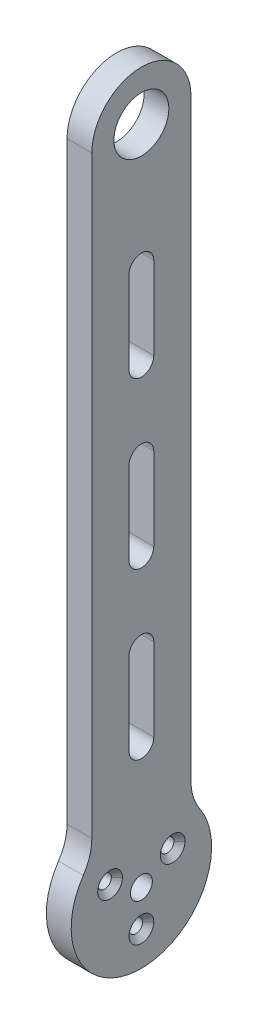
ISO-10303-21;
HEADER;
FILE_DESCRIPTION(('STEP AP214'),'2;1');
FILE_NAME('part.step','',(''),(''),'','','');
FILE_SCHEMA(('AUTOMOTIVE_DESIGN { 1 0 10303 214 1 1 1 1 }'));
ENDSEC;
DATA;
#1=APPLICATION_CONTEXT('core data for automotive mechanical design processes');
#2=APPLICATION_PROTOCOL_DEFINITION('international standard','automotive_design',2000,#1);
#3=PRODUCT_CONTEXT('',#1,'mechanical');
#4=PRODUCT('Part','Part','',(#3));
#5=PRODUCT_RELATED_PRODUCT_CATEGORY('part','',(#4));
#6=PRODUCT_DEFINITION_FORMATION('','',#4);
#7=PRODUCT_DEFINITION_CONTEXT('part definition',#1,'design');
#8=PRODUCT_DEFINITION('design','',#6,#7);
#9=PRODUCT_DEFINITION_SHAPE('','',#8);
#10=(LENGTH_UNIT() NAMED_UNIT(*) SI_UNIT(.MILLI.,.METRE.));
#11=(NAMED_UNIT(*) PLANE_ANGLE_UNIT() SI_UNIT($,.RADIAN.));
#12=(NAMED_UNIT(*) SI_UNIT($,.STERADIAN.) SOLID_ANGLE_UNIT());
#13=UNCERTAINTY_MEASURE_WITH_UNIT(LENGTH_MEASURE(1.E-05),#10,'distance_accuracy_value','');
#14=(GEOMETRIC_REPRESENTATION_CONTEXT(3) GLOBAL_UNCERTAINTY_ASSIGNED_CONTEXT((#13)) GLOBAL_UNIT_ASSIGNED_CONTEXT((#10,
#11,#12)) REPRESENTATION_CONTEXT('',''));
#15=CARTESIAN_POINT('',(0.,0.,0.));
#16=DIRECTION('',(0.,0.,1.));
#17=DIRECTION('',(1.,0.,0.));
#18=AXIS2_PLACEMENT_3D('',#15,#16,#17);
#19=CARTESIAN_POINT('',(1.4159414336793,4.375,7.57772228311384));
#20=DIRECTION('',(1.,0.,0.));
#21=DIRECTION('',(0.,0.,-1.));
#22=AXIS2_PLACEMENT_3D('',#19,#20,#21);
#23=CONICAL_SURFACE('',#22,1.4159414336793,0.785398163397449);
#24=DIRECTION('',(-0.707106781186547,-4.31774598039509E-08,-0.707106781186546));
#25=VECTOR('',#24,1.);
#26=CARTESIAN_POINT('',(2.99999998662978,4.37500018318645,10.5777222697436));
#27=LINE('',#26,#25);
#28=CARTESIAN_POINT('',(2.99999999539441,4.37500005514268,10.5777222785082));
#29=VERTEX_POINT('',#28);
#30=CARTESIAN_POINT('',(1.65,4.37500010075255,9.22772228311382));
#31=VERTEX_POINT('',#30);
#32=EDGE_CURVE('E55',#29,#31,#27,.T.);
#33=ORIENTED_EDGE('',*,*,#32,.T.);
#34=CARTESIAN_POINT('',(1.65,4.375,7.57772228311384));
#35=DIRECTION('',(1.,0.,0.));
#36=DIRECTION('',(0.,0.,-1.));
#37=AXIS2_PLACEMENT_3D('',#34,#35,#36);
#38=CIRCLE('',#37,1.65);
#39=CARTESIAN_POINT('',(1.65,4.37499989924745,5.92772228311384));
#40=VERTEX_POINT('',#39);
#41=EDGE_CURVE('E375',#31,#40,#38,.F.);
#42=ORIENTED_EDGE('',*,*,#41,.T.);
#43=DIRECTION('',(-0.707106781186547,4.31774602128291E-08,0.707106781186546));
#44=VECTOR('',#43,1.);
#45=CARTESIAN_POINT('',(2.99999998662978,4.37499981681355,4.57772229648406));
#46=LINE('',#45,#44);
#47=CARTESIAN_POINT('',(2.99999999539441,4.37499994485732,4.57772228771943));
#48=VERTEX_POINT('',#47);
#49=EDGE_CURVE('E12',#48,#40,#46,.T.);
#50=ORIENTED_EDGE('',*,*,#49,.F.);
#51=CARTESIAN_POINT('',(3.,4.375,7.57772228311384));
#52=DIRECTION('',(-1.,0.,0.));
#53=DIRECTION('',(0.,0.,1.));
#54=AXIS2_PLACEMENT_3D('',#51,#52,#53);
#55=CIRCLE('',#54,3.);
#56=EDGE_CURVE('E464',#29,#48,#55,.T.);
#57=ORIENTED_EDGE('',*,*,#56,.F.);
#58=EDGE_LOOP('',(#33,#42,#50,#57));
#59=FACE_BOUND('',#58,.T.);
#60=ADVANCED_FACE('F52',(#59),#23,.F.);
#61=CARTESIAN_POINT('',(1.4159414336793,4.375,7.57772228311384));
#62=DIRECTION('',(1.,0.,0.));
#63=DIRECTION('',(0.,0.,-1.));
#64=AXIS2_PLACEMENT_3D('',#61,#62,#63);
#65=CONICAL_SURFACE('',#64,1.4159414336793,0.785398163397449);
#66=ORIENTED_EDGE('',*,*,#49,.T.);
#67=CARTESIAN_POINT('',(1.65,4.375,7.57772228311384));
#68=DIRECTION('',(1.,0.,0.));
#69=DIRECTION('',(0.,0.,-1.));
#70=AXIS2_PLACEMENT_3D('',#67,#68,#69);
#71=CIRCLE('',#70,1.65);
#72=EDGE_CURVE('E371',#40,#31,#71,.F.);
#73=ORIENTED_EDGE('',*,*,#72,.T.);
#74=ORIENTED_EDGE('',*,*,#32,.F.);
#75=CARTESIAN_POINT('',(3.,4.375,7.57772228311384));
#76=DIRECTION('',(-1.,0.,0.));
#77=DIRECTION('',(0.,0.,-1.));
#78=AXIS2_PLACEMENT_3D('',#75,#76,#77);
#79=CIRCLE('',#78,3.);
#80=EDGE_CURVE('E460',#48,#29,#79,.T.);
#81=ORIENTED_EDGE('',*,*,#80,.F.);
#82=EDGE_LOOP('',(#66,#73,#74,#81));
#83=FACE_BOUND('',#82,.T.);
#84=ADVANCED_FACE('F539',(#83),#65,.F.);
#85=CARTESIAN_POINT('',(1.4159414336793,4.375,-7.57772228311384));
#86=DIRECTION('',(1.,0.,0.));
#87=DIRECTION('',(0.,0.,-1.));
#88=AXIS2_PLACEMENT_3D('',#85,#86,#87);
#89=CONICAL_SURFACE('',#88,1.4159414336793,0.785398163397449);
#90=DIRECTION('',(-0.707106781186547,-4.31774606217073E-08,-0.707106781186546));
#91=VECTOR('',#90,1.);
#92=CARTESIAN_POINT('',(2.99999998662979,4.37500018318645,-4.57772229648406));
#93=LINE('',#92,#91);
#94=CARTESIAN_POINT('',(2.99999999539441,4.37500005514268,-4.57772228771943));
#95=VERTEX_POINT('',#94);
#96=CARTESIAN_POINT('',(1.65,4.37500010075255,-5.92772228311385));
#97=VERTEX_POINT('',#96);
#98=EDGE_CURVE('E485',#95,#97,#93,.T.);
#99=ORIENTED_EDGE('',*,*,#98,.T.);
#100=CARTESIAN_POINT('',(1.65,4.375,-7.57772228311384));
#101=DIRECTION('',(1.,0.,0.));
#102=DIRECTION('',(0.,0.,-1.));
#103=AXIS2_PLACEMENT_3D('',#100,#101,#102);
#104=CIRCLE('',#103,1.65);
#105=CARTESIAN_POINT('',(1.65,4.37499989924745,-9.22772228311382));
#106=VERTEX_POINT('',#105);
#107=EDGE_CURVE('E383',#97,#106,#104,.F.);
#108=ORIENTED_EDGE('',*,*,#107,.T.);
#109=DIRECTION('',(-0.707106781186548,4.31774598039509E-08,0.707106781186546));
#110=VECTOR('',#109,1.);
#111=CARTESIAN_POINT('',(2.99999998662978,4.37499981681355,-10.5777222697436));
#112=LINE('',#111,#110);
#113=CARTESIAN_POINT('',(2.99999999539441,4.37499994485732,-10.5777222785082));
#114=VERTEX_POINT('',#113);
#115=EDGE_CURVE('E489',#114,#106,#112,.T.);
#116=ORIENTED_EDGE('',*,*,#115,.F.);
#117=CARTESIAN_POINT('',(3.,4.375,-7.57772228311384));
#118=DIRECTION('',(-1.,0.,0.));
#119=DIRECTION('',(0.,0.,1.));
#120=AXIS2_PLACEMENT_3D('',#117,#118,#119);
#121=CIRCLE('',#120,3.);
#122=EDGE_CURVE('E456',#95,#114,#121,.T.);
#123=ORIENTED_EDGE('',*,*,#122,.F.);
#124=EDGE_LOOP('',(#99,#108,#116,#123));
#125=FACE_BOUND('',#124,.T.);
#126=ADVANCED_FACE('F497',(#125),#89,.F.);
#127=CARTESIAN_POINT('',(1.4159414336793,4.375,-7.57772228311384));
#128=DIRECTION('',(1.,0.,0.));
#129=DIRECTION('',(0.,0.,-1.));
#130=AXIS2_PLACEMENT_3D('',#127,#128,#129);
#131=CONICAL_SURFACE('',#130,1.4159414336793,0.785398163397449);
#132=ORIENTED_EDGE('',*,*,#115,.T.);
#133=CARTESIAN_POINT('',(1.65,4.375,-7.57772228311384));
#134=DIRECTION('',(1.,0.,0.));
#135=DIRECTION('',(0.,0.,-1.));
#136=AXIS2_PLACEMENT_3D('',#133,#134,#135);
#137=CIRCLE('',#136,1.65);
#138=EDGE_CURVE('E379',#106,#97,#137,.F.);
#139=ORIENTED_EDGE('',*,*,#138,.T.);
#140=ORIENTED_EDGE('',*,*,#98,.F.);
#141=CARTESIAN_POINT('',(3.,4.375,-7.57772228311384));
#142=DIRECTION('',(-1.,0.,0.));
#143=DIRECTION('',(0.,0.,-1.));
#144=AXIS2_PLACEMENT_3D('',#141,#142,#143);
#145=CIRCLE('',#144,3.);
#146=EDGE_CURVE('E452',#114,#95,#145,.T.);
#147=ORIENTED_EDGE('',*,*,#146,.F.);
#148=EDGE_LOOP('',(#132,#139,#140,#147));
#149=FACE_BOUND('',#148,.T.);
#150=ADVANCED_FACE('F500',(#149),#131,.F.);
#151=CARTESIAN_POINT('',(1.4159414336793,-8.75,0.));
#152=DIRECTION('',(1.,0.,0.));
#153=DIRECTION('',(0.,0.,-1.));
#154=AXIS2_PLACEMENT_3D('',#151,#152,#153);
#155=CONICAL_SURFACE('',#154,1.4159414336793,0.785398163397449);
#156=DIRECTION('',(-0.707106781186547,-4.31774610305856E-08,-0.707106781186546));
#157=VECTOR('',#156,1.);
#158=CARTESIAN_POINT('',(2.99999998662978,-8.74999981681355,2.99999998662978));
#159=LINE('',#158,#157);
#160=CARTESIAN_POINT('',(2.99999999539441,-8.74999994485732,2.99999999539441));
#161=VERTEX_POINT('',#160);
#162=CARTESIAN_POINT('',(1.65,-8.74999989924745,1.65));
#163=VERTEX_POINT('',#162);
#164=EDGE_CURVE('E474',#161,#163,#159,.T.);
#165=ORIENTED_EDGE('',*,*,#164,.T.);
#166=CARTESIAN_POINT('',(1.65,-8.75,0.));
#167=DIRECTION('',(1.,0.,0.));
#168=DIRECTION('',(0.,0.,-1.));
#169=AXIS2_PLACEMENT_3D('',#166,#167,#168);
#170=CIRCLE('',#169,1.65);
#171=CARTESIAN_POINT('',(1.65,-8.75000010075255,-1.65));
#172=VERTEX_POINT('',#171);
#173=EDGE_CURVE('E367',#163,#172,#170,.F.);
#174=ORIENTED_EDGE('',*,*,#173,.T.);
#175=DIRECTION('',(-0.707106781186547,4.31774585773161E-08,0.707106781186546));
#176=VECTOR('',#175,1.);
#177=CARTESIAN_POINT('',(2.99999998662978,-8.75000018318645,-2.99999998662978));
#178=LINE('',#177,#176);
#179=CARTESIAN_POINT('',(2.99999999539441,-8.75000005514268,-2.99999999539441));
#180=VERTEX_POINT('',#179);
#181=EDGE_CURVE('E481',#180,#172,#178,.T.);
#182=ORIENTED_EDGE('',*,*,#181,.F.);
#183=CARTESIAN_POINT('',(3.,-8.75,0.));
#184=DIRECTION('',(-1.,0.,0.));
#185=DIRECTION('',(0.,0.,1.));
#186=AXIS2_PLACEMENT_3D('',#183,#184,#185);
#187=CIRCLE('',#186,3.);
#188=EDGE_CURVE('E448',#161,#180,#187,.T.);
#189=ORIENTED_EDGE('',*,*,#188,.F.);
#190=EDGE_LOOP('',(#165,#174,#182,#189));
#191=FACE_BOUND('',#190,.T.);
#192=ADVANCED_FACE('F772',(#191),#155,.F.);
#193=CARTESIAN_POINT('',(1.4159414336793,-8.75,0.));
#194=DIRECTION('',(1.,0.,0.));
#195=DIRECTION('',(0.,0.,-1.));
#196=AXIS2_PLACEMENT_3D('',#193,#194,#195);
#197=CONICAL_SURFACE('',#196,1.4159414336793,0.785398163397449);
#198=ORIENTED_EDGE('',*,*,#181,.T.);
#199=CARTESIAN_POINT('',(1.65,-8.75,0.));
#200=DIRECTION('',(1.,0.,0.));
#201=DIRECTION('',(0.,0.,-1.));
#202=AXIS2_PLACEMENT_3D('',#199,#200,#201);
#203=CIRCLE('',#202,1.65);
#204=EDGE_CURVE('E363',#172,#163,#203,.F.);
#205=ORIENTED_EDGE('',*,*,#204,.T.);
#206=ORIENTED_EDGE('',*,*,#164,.F.);
#207=CARTESIAN_POINT('',(3.,-8.75,0.));
#208=DIRECTION('',(-1.,0.,0.));
#209=DIRECTION('',(0.,0.,-1.));
#210=AXIS2_PLACEMENT_3D('',#207,#208,#209);
#211=CIRCLE('',#210,3.);
#212=EDGE_CURVE('E444',#180,#161,#211,.T.);
#213=ORIENTED_EDGE('',*,*,#212,.F.);
#214=EDGE_LOOP('',(#198,#205,#206,#213));
#215=FACE_BOUND('',#214,.T.);
#216=ADVANCED_FACE('F760',(#215),#197,.F.);
#217=CARTESIAN_POINT('',(-18.036,16.2788205960997,-24.));
#218=DIRECTION('',(1.,0.,0.));
#219=DIRECTION('',(0.,0.,1.));
#220=AXIS2_PLACEMENT_3D('',#217,#218,#219);
#221=CYLINDRICAL_SURFACE('',#220,12.);
#222=CARTESIAN_POINT('',(3.,16.2788205960997,-24.));
#223=DIRECTION('',(-1.,0.,0.));
#224=DIRECTION('',(0.,-0.561338641244817,0.827586206896552));
#225=AXIS2_PLACEMENT_3D('',#222,#223,#224);
#226=CIRCLE('',#225,12.);
#227=CARTESIAN_POINT('',(3.,9.5427569011619,-14.0689655172414));
#228=VERTEX_POINT('',#227);
#229=CARTESIAN_POINT('',(3.,16.2788205960997,-12.));
#230=VERTEX_POINT('',#229);
#231=EDGE_CURVE('E443',#228,#230,#226,.T.);
#232=ORIENTED_EDGE('',*,*,#231,.F.);
#233=DIRECTION('',(1.,0.,0.));
#234=VECTOR('',#233,1.);
#235=CARTESIAN_POINT('',(-3.,9.5427569011619,-14.0689655172414));
#236=LINE('',#235,#234);
#237=CARTESIAN_POINT('',(-3.,9.5427569011619,-14.0689655172414));
#238=VERTEX_POINT('',#237);
#239=EDGE_CURVE('E426',#238,#228,#236,.T.);
#240=ORIENTED_EDGE('',*,*,#239,.F.);
#241=CARTESIAN_POINT('',(-3.,16.2788205960997,-24.));
#242=DIRECTION('',(1.,0.,0.));
#243=DIRECTION('',(0.,0.,1.));
#244=AXIS2_PLACEMENT_3D('',#241,#242,#243);
#245=CIRCLE('',#244,12.);
#246=CARTESIAN_POINT('',(-3.,16.2788205960997,-12.));
#247=VERTEX_POINT('',#246);
#248=EDGE_CURVE('E400',#247,#238,#245,.T.);
#249=ORIENTED_EDGE('',*,*,#248,.F.);
#250=DIRECTION('',(1.,0.,0.));
#251=VECTOR('',#250,1.);
#252=CARTESIAN_POINT('',(-3.,16.2788205960997,-12.));
#253=LINE('',#252,#251);
#254=EDGE_CURVE('E471',#247,#230,#253,.T.);
#255=ORIENTED_EDGE('',*,*,#254,.T.);
#256=EDGE_LOOP('',(#232,#240,#249,#255));
#257=FACE_BOUND('',#256,.T.);
#258=ADVANCED_FACE('F748',(#257),#221,.F.);
#259=CARTESIAN_POINT('',(-3.,12.0415945787923,-12.));
#260=DIRECTION('',(0.,0.,-1.));
#261=DIRECTION('',(0.,1.,0.));
#262=AXIS2_PLACEMENT_3D('',#259,#260,#261);
#263=PLANE('',#262);
#264=DIRECTION('',(0.,1.,0.));
#265=VECTOR('',#264,1.);
#266=CARTESIAN_POINT('',(-3.,16.2788205960997,-12.));
#267=LINE('',#266,#265);
#268=CARTESIAN_POINT('',(-3.,160.,-12.));
#269=VERTEX_POINT('',#268);
#270=EDGE_CURVE('E401',#247,#269,#267,.T.);
#271=ORIENTED_EDGE('',*,*,#270,.T.);
#272=DIRECTION('',(1.,0.,0.));
#273=VECTOR('',#272,1.);
#274=CARTESIAN_POINT('',(-3.,160.,-12.));
#275=LINE('',#274,#273);
#276=CARTESIAN_POINT('',(3.,160.,-12.));
#277=VERTEX_POINT('',#276);
#278=EDGE_CURVE('E468',#269,#277,#275,.T.);
#279=ORIENTED_EDGE('',*,*,#278,.T.);
#280=DIRECTION('',(0.,1.,0.));
#281=VECTOR('',#280,1.);
#282=CARTESIAN_POINT('',(3.,16.2788205960997,-12.));
#283=LINE('',#282,#281);
#284=EDGE_CURVE('E439',#230,#277,#283,.T.);
#285=ORIENTED_EDGE('',*,*,#284,.F.);
#286=ORIENTED_EDGE('',*,*,#254,.F.);
#287=EDGE_LOOP('',(#271,#279,#285,#286));
#288=FACE_BOUND('',#287,.T.);
#289=ADVANCED_FACE('F735',(#288),#263,.T.);
#290=CARTESIAN_POINT('',(-3.,160.,0.));
#291=DIRECTION('',(1.,0.,0.));
#292=DIRECTION('',(0.,0.,-1.));
#293=AXIS2_PLACEMENT_3D('',#290,#291,#292);
#294=CYLINDRICAL_SURFACE('',#293,12.);
#295=DIRECTION('',(1.,0.,0.));
#296=VECTOR('',#295,1.);
#297=CARTESIAN_POINT('',(-3.,160.,12.));
#298=LINE('',#297,#296);
#299=CARTESIAN_POINT('',(-3.,160.,12.));
#300=VERTEX_POINT('',#299);
#301=CARTESIAN_POINT('',(3.,160.,12.));
#302=VERTEX_POINT('',#301);
#303=EDGE_CURVE('E411',#300,#302,#298,.T.);
#304=ORIENTED_EDGE('',*,*,#303,.T.);
#305=CARTESIAN_POINT('',(3.,160.,0.));
#306=DIRECTION('',(1.,0.,0.));
#307=DIRECTION('',(0.,0.,-1.));
#308=AXIS2_PLACEMENT_3D('',#305,#306,#307);
#309=CIRCLE('',#308,12.);
#310=EDGE_CURVE('E430',#277,#302,#309,.T.);
#311=ORIENTED_EDGE('',*,*,#310,.F.);
#312=ORIENTED_EDGE('',*,*,#278,.F.);
#313=CARTESIAN_POINT('',(-3.,160.,0.));
#314=DIRECTION('',(1.,0.,0.));
#315=DIRECTION('',(0.,0.,-1.));
#316=AXIS2_PLACEMENT_3D('',#313,#314,#315);
#317=CIRCLE('',#316,12.);
#318=EDGE_CURVE('E404',#269,#300,#317,.T.);
#319=ORIENTED_EDGE('',*,*,#318,.T.);
#320=EDGE_LOOP('',(#304,#311,#312,#319));
#321=FACE_BOUND('',#320,.T.);
#322=ADVANCED_FACE('F506',(#321),#294,.T.);
#323=CARTESIAN_POINT('',(3.,0.,0.));
#324=DIRECTION('',(1.,0.,0.));
#325=DIRECTION('',(0.,0.,-1.));
#326=AXIS2_PLACEMENT_3D('',#323,#324,#325);
#327=PLANE('',#326);
#328=CARTESIAN_POINT('',(3.,30.,0.));
#329=DIRECTION('',(1.,0.,0.));
#330=DIRECTION('',(0.,0.,-1.));
#331=AXIS2_PLACEMENT_3D('',#328,#329,#330);
#332=CIRCLE('',#331,3.);
#333=CARTESIAN_POINT('',(3.,30.,3.00000000000001));
#334=VERTEX_POINT('',#333);
#335=CARTESIAN_POINT('',(3.,30.,-2.99999999999999));
#336=VERTEX_POINT('',#335);
#337=EDGE_CURVE('E336',#334,#336,#332,.T.);
#338=ORIENTED_EDGE('',*,*,#337,.F.);
#339=DIRECTION('',(0.,-1.,0.));
#340=VECTOR('',#339,1.);
#341=CARTESIAN_POINT('',(3.,0.,3.00000000000001));
#342=LINE('',#341,#340);
#343=CARTESIAN_POINT('',(3.,50.,3.00000000000001));
#344=VERTEX_POINT('',#343);
#345=EDGE_CURVE('E326',#344,#334,#342,.T.);
#346=ORIENTED_EDGE('',*,*,#345,.F.);
#347=CARTESIAN_POINT('',(3.,50.,0.));
#348=DIRECTION('',(1.,0.,0.));
#349=DIRECTION('',(0.,0.,-1.));
#350=AXIS2_PLACEMENT_3D('',#347,#348,#349);
#351=CIRCLE('',#350,3.);
#352=CARTESIAN_POINT('',(3.,50.,-2.99999999999999));
#353=VERTEX_POINT('',#352);
#354=EDGE_CURVE('E329',#353,#344,#351,.T.);
#355=ORIENTED_EDGE('',*,*,#354,.F.);
#356=DIRECTION('',(0.,-1.,0.));
#357=VECTOR('',#356,1.);
#358=CARTESIAN_POINT('',(3.,0.,-2.99999999999999));
#359=LINE('',#358,#357);
#360=EDGE_CURVE('E332',#353,#336,#359,.T.);
#361=ORIENTED_EDGE('',*,*,#360,.T.);
#362=EDGE_LOOP('',(#338,#346,#355,#361));
#363=FACE_BOUND('',#362,.T.);
#364=CARTESIAN_POINT('',(3.,110.,0.));
#365=DIRECTION('',(1.,0.,0.));
#366=DIRECTION('',(0.,0.,-1.));
#367=AXIS2_PLACEMENT_3D('',#364,#365,#366);
#368=CIRCLE('',#367,3.);
#369=CARTESIAN_POINT('',(3.,110.,3.));
#370=VERTEX_POINT('',#369);
#371=CARTESIAN_POINT('',(3.,110.,-3.));
#372=VERTEX_POINT('',#371);
#373=EDGE_CURVE('E220',#370,#372,#368,.T.);
#374=ORIENTED_EDGE('',*,*,#373,.F.);
#375=DIRECTION('',(0.,-1.,0.));
#376=VECTOR('',#375,1.);
#377=CARTESIAN_POINT('',(3.,0.,3.));
#378=LINE('',#377,#376);
#379=CARTESIAN_POINT('',(3.,130.,3.));
#380=VERTEX_POINT('',#379);
#381=EDGE_CURVE('E315',#380,#370,#378,.T.);
#382=ORIENTED_EDGE('',*,*,#381,.F.);
#383=CARTESIAN_POINT('',(3.,130.,0.));
#384=DIRECTION('',(1.,0.,0.));
#385=DIRECTION('',(0.,0.,-1.));
#386=AXIS2_PLACEMENT_3D('',#383,#384,#385);
#387=CIRCLE('',#386,3.);
#388=CARTESIAN_POINT('',(3.,130.,-3.));
#389=VERTEX_POINT('',#388);
#390=EDGE_CURVE('E318',#389,#380,#387,.T.);
#391=ORIENTED_EDGE('',*,*,#390,.F.);
#392=DIRECTION('',(0.,-1.,0.));
#393=VECTOR('',#392,1.);
#394=CARTESIAN_POINT('',(3.,0.,-3.));
#395=LINE('',#394,#393);
#396=EDGE_CURVE('E321',#389,#372,#395,.T.);
#397=ORIENTED_EDGE('',*,*,#396,.T.);
#398=EDGE_LOOP('',(#374,#382,#391,#397));
#399=FACE_BOUND('',#398,.T.);
#400=CARTESIAN_POINT('',(3.,70.,0.));
#401=DIRECTION('',(1.,0.,0.));
#402=DIRECTION('',(0.,0.,-1.));
#403=AXIS2_PLACEMENT_3D('',#400,#401,#402);
#404=CIRCLE('',#403,3.);
#405=CARTESIAN_POINT('',(3.,70.,3.00000000000001));
#406=VERTEX_POINT('',#405);
#407=CARTESIAN_POINT('',(3.,70.,-2.99999999999999));
#408=VERTEX_POINT('',#407);
#409=EDGE_CURVE('E312',#406,#408,#404,.T.);
#410=ORIENTED_EDGE('',*,*,#409,.F.);
#411=DIRECTION('',(0.,-1.,0.));
#412=VECTOR('',#411,1.);
#413=CARTESIAN_POINT('',(3.,0.,3.00000000000001));
#414=LINE('',#413,#412);
#415=CARTESIAN_POINT('',(3.,90.,3.00000000000001));
#416=VERTEX_POINT('',#415);
#417=EDGE_CURVE('E292',#416,#406,#414,.T.);
#418=ORIENTED_EDGE('',*,*,#417,.F.);
#419=CARTESIAN_POINT('',(3.,90.,0.));
#420=DIRECTION('',(1.,0.,0.));
#421=DIRECTION('',(0.,0.,-1.));
#422=AXIS2_PLACEMENT_3D('',#419,#420,#421);
#423=CIRCLE('',#422,3.);
#424=CARTESIAN_POINT('',(3.,90.,-2.99999999999999));
#425=VERTEX_POINT('',#424);
#426=EDGE_CURVE('E304',#425,#416,#423,.T.);
#427=ORIENTED_EDGE('',*,*,#426,.F.);
#428=DIRECTION('',(0.,-1.,0.));
#429=VECTOR('',#428,1.);
#430=CARTESIAN_POINT('',(3.,0.,-2.99999999999999));
#431=LINE('',#430,#429);
#432=EDGE_CURVE('E308',#425,#408,#431,.T.);
#433=ORIENTED_EDGE('',*,*,#432,.T.);
#434=EDGE_LOOP('',(#410,#418,#427,#433));
#435=FACE_BOUND('',#434,.T.);
#436=ORIENTED_EDGE('',*,*,#231,.T.);
#437=ORIENTED_EDGE('',*,*,#284,.T.);
#438=ORIENTED_EDGE('',*,*,#310,.T.);
#439=DIRECTION('',(0.,-1.,0.));
#440=VECTOR('',#439,1.);
#441=CARTESIAN_POINT('',(3.,160.,12.));
#442=LINE('',#441,#440);
#443=CARTESIAN_POINT('',(3.,16.2788205960997,12.));
#444=VERTEX_POINT('',#443);
#445=EDGE_CURVE('E414',#302,#444,#442,.T.);
#446=ORIENTED_EDGE('',*,*,#445,.T.);
#447=CARTESIAN_POINT('',(3.,16.2788205960997,24.));
#448=DIRECTION('',(-1.,0.,0.));
#449=DIRECTION('',(0.,0.,-1.));
#450=AXIS2_PLACEMENT_3D('',#447,#448,#449);
#451=CIRCLE('',#450,12.);
#452=CARTESIAN_POINT('',(3.,9.5427569011619,14.0689655172414));
#453=VERTEX_POINT('',#452);
#454=EDGE_CURVE('E418',#444,#453,#451,.T.);
#455=ORIENTED_EDGE('',*,*,#454,.T.);
#456=CARTESIAN_POINT('',(3.,0.,0.));
#457=DIRECTION('',(1.,0.,0.));
#458=DIRECTION('',(0.,0.561338641244818,0.827586206896552));
#459=AXIS2_PLACEMENT_3D('',#456,#457,#458);
#460=CIRCLE('',#459,17.);
#461=EDGE_CURVE('E421',#453,#228,#460,.T.);
#462=ORIENTED_EDGE('',*,*,#461,.T.);
#463=EDGE_LOOP('',(#436,#437,#438,#446,#455,#462));
#464=FACE_BOUND('',#463,.T.);
#465=ORIENTED_EDGE('',*,*,#188,.T.);
#466=ORIENTED_EDGE('',*,*,#212,.T.);
#467=EDGE_LOOP('',(#465,#466));
#468=FACE_BOUND('',#467,.T.);
#469=ORIENTED_EDGE('',*,*,#122,.T.);
#470=ORIENTED_EDGE('',*,*,#146,.T.);
#471=EDGE_LOOP('',(#469,#470));
#472=FACE_BOUND('',#471,.T.);
#473=ORIENTED_EDGE('',*,*,#56,.T.);
#474=ORIENTED_EDGE('',*,*,#80,.T.);
#475=EDGE_LOOP('',(#473,#474));
#476=FACE_BOUND('',#475,.T.);
#477=CARTESIAN_POINT('',(3.,0.,0.));
#478=DIRECTION('',(1.,0.,0.));
#479=DIRECTION('',(0.,0.,-1.));
#480=AXIS2_PLACEMENT_3D('',#477,#478,#479);
#481=CIRCLE('',#480,2.65);
#482=CARTESIAN_POINT('',(3.,0.,-2.65));
#483=VERTEX_POINT('',#482);
#484=EDGE_CURVE('E344',#483,#483,#481,.T.);
#485=ORIENTED_EDGE('',*,*,#484,.F.);
#486=EDGE_LOOP('',(#485));
#487=FACE_BOUND('',#486,.T.);
#488=CARTESIAN_POINT('',(3.,160.,0.));
#489=DIRECTION('',(1.,0.,0.));
#490=DIRECTION('',(0.,0.,-1.));
#491=AXIS2_PLACEMENT_3D('',#488,#489,#490);
#492=CIRCLE('',#491,6.65);
#493=CARTESIAN_POINT('',(3.,160.,-6.65));
#494=VERTEX_POINT('',#493);
#495=EDGE_CURVE('E387',#494,#494,#492,.T.);
#496=ORIENTED_EDGE('',*,*,#495,.F.);
#497=EDGE_LOOP('',(#496));
#498=FACE_BOUND('',#497,.T.);
#499=ADVANCED_FACE('F502',(#363,#399,#435,#464,#468,#472,#476,#487,#498),#327,.T.);
#500=CARTESIAN_POINT('',(-3.,0.,0.));
#501=DIRECTION('',(1.,0.,0.));
#502=DIRECTION('',(0.,0.,-1.));
#503=AXIS2_PLACEMENT_3D('',#500,#501,#502);
#504=CYLINDRICAL_SURFACE('',#503,17.);
#505=ORIENTED_EDGE('',*,*,#239,.T.);
#506=ORIENTED_EDGE('',*,*,#461,.F.);
#507=DIRECTION('',(1.,0.,0.));
#508=VECTOR('',#507,1.);
#509=CARTESIAN_POINT('',(-3.,9.5427569011619,14.0689655172414));
#510=LINE('',#509,#508);
#511=CARTESIAN_POINT('',(-3.,9.5427569011619,14.0689655172414));
#512=VERTEX_POINT('',#511);
#513=EDGE_CURVE('E422',#512,#453,#510,.T.);
#514=ORIENTED_EDGE('',*,*,#513,.F.);
#515=CARTESIAN_POINT('',(-3.,0.,0.));
#516=DIRECTION('',(1.,0.,0.));
#517=DIRECTION('',(0.,0.561338641244818,0.827586206896552));
#518=AXIS2_PLACEMENT_3D('',#515,#516,#517);
#519=CIRCLE('',#518,17.);
#520=EDGE_CURVE('E396',#512,#238,#519,.T.);
#521=ORIENTED_EDGE('',*,*,#520,.T.);
#522=EDGE_LOOP('',(#505,#506,#514,#521));
#523=FACE_BOUND('',#522,.T.);
#524=ADVANCED_FACE('F505',(#523),#504,.T.);
#525=CARTESIAN_POINT('',(-18.036,16.2788205960997,24.));
#526=DIRECTION('',(1.,0.,0.));
#527=DIRECTION('',(0.,-0.561338641244817,-0.827586206896552));
#528=AXIS2_PLACEMENT_3D('',#525,#526,#527);
#529=CYLINDRICAL_SURFACE('',#528,12.);
#530=ORIENTED_EDGE('',*,*,#454,.F.);
#531=DIRECTION('',(1.,0.,0.));
#532=VECTOR('',#531,1.);
#533=CARTESIAN_POINT('',(-3.,16.2788205960997,12.));
#534=LINE('',#533,#532);
#535=CARTESIAN_POINT('',(-3.,16.2788205960997,12.));
#536=VERTEX_POINT('',#535);
#537=EDGE_CURVE('E407',#536,#444,#534,.T.);
#538=ORIENTED_EDGE('',*,*,#537,.F.);
#539=CARTESIAN_POINT('',(-3.,16.2788205960997,24.));
#540=DIRECTION('',(1.,0.,0.));
#541=DIRECTION('',(0.,-0.561338641244817,-0.827586206896552));
#542=AXIS2_PLACEMENT_3D('',#539,#540,#541);
#543=CIRCLE('',#542,12.);
#544=EDGE_CURVE('E395',#512,#536,#543,.T.);
#545=ORIENTED_EDGE('',*,*,#544,.F.);
#546=ORIENTED_EDGE('',*,*,#513,.T.);
#547=EDGE_LOOP('',(#530,#538,#545,#546));
#548=FACE_BOUND('',#547,.T.);
#549=ADVANCED_FACE('F534',(#548),#529,.F.);
#550=CARTESIAN_POINT('',(-3.,160.,12.));
#551=DIRECTION('',(0.,0.,1.));
#552=DIRECTION('',(0.,-1.,0.));
#553=AXIS2_PLACEMENT_3D('',#550,#551,#552);
#554=PLANE('',#553);
#555=ORIENTED_EDGE('',*,*,#445,.F.);
#556=ORIENTED_EDGE('',*,*,#303,.F.);
#557=DIRECTION('',(0.,-1.,0.));
#558=VECTOR('',#557,1.);
#559=CARTESIAN_POINT('',(-3.,160.,12.));
#560=LINE('',#559,#558);
#561=EDGE_CURVE('E391',#300,#536,#560,.T.);
#562=ORIENTED_EDGE('',*,*,#561,.T.);
#563=ORIENTED_EDGE('',*,*,#537,.T.);
#564=EDGE_LOOP('',(#555,#556,#562,#563));
#565=FACE_BOUND('',#564,.T.);
#566=ADVANCED_FACE('F524',(#565),#554,.T.);
#567=CARTESIAN_POINT('',(-3.,0.,0.));
#568=DIRECTION('',(1.,0.,0.));
#569=DIRECTION('',(0.,0.,-1.));
#570=AXIS2_PLACEMENT_3D('',#567,#568,#569);
#571=PLANE('',#570);
#572=DIRECTION('',(0.,1.,0.));
#573=VECTOR('',#572,1.);
#574=CARTESIAN_POINT('',(-3.,30.,3.00000000000001));
#575=LINE('',#574,#573);
#576=CARTESIAN_POINT('',(-3.,30.,3.00000000000001));
#577=VERTEX_POINT('',#576);
#578=CARTESIAN_POINT('',(-3.,50.,3.00000000000001));
#579=VERTEX_POINT('',#578);
#580=EDGE_CURVE('E272',#577,#579,#575,.T.);
#581=ORIENTED_EDGE('',*,*,#580,.F.);
#582=CARTESIAN_POINT('',(-3.,30.,0.));
#583=DIRECTION('',(-1.,0.,0.));
#584=DIRECTION('',(0.,0.,1.));
#585=AXIS2_PLACEMENT_3D('',#582,#583,#584);
#586=CIRCLE('',#585,3.);
#587=CARTESIAN_POINT('',(-3.,30.,-2.99999999999999));
#588=VERTEX_POINT('',#587);
#589=EDGE_CURVE('E225',#588,#577,#586,.T.);
#590=ORIENTED_EDGE('',*,*,#589,.F.);
#591=DIRECTION('',(0.,1.,0.));
#592=VECTOR('',#591,1.);
#593=CARTESIAN_POINT('',(-3.,30.,-2.99999999999999));
#594=LINE('',#593,#592);
#595=CARTESIAN_POINT('',(-3.,50.,-2.99999999999999));
#596=VERTEX_POINT('',#595);
#597=EDGE_CURVE('E256',#588,#596,#594,.T.);
#598=ORIENTED_EDGE('',*,*,#597,.T.);
#599=CARTESIAN_POINT('',(-3.,50.,0.));
#600=DIRECTION('',(-1.,0.,0.));
#601=DIRECTION('',(0.,0.,1.));
#602=AXIS2_PLACEMENT_3D('',#599,#600,#601);
#603=CIRCLE('',#602,3.);
#604=EDGE_CURVE('E268',#579,#596,#603,.T.);
#605=ORIENTED_EDGE('',*,*,#604,.F.);
#606=EDGE_LOOP('',(#581,#590,#598,#605));
#607=FACE_BOUND('',#606,.T.);
#608=DIRECTION('',(0.,1.,0.));
#609=VECTOR('',#608,1.);
#610=CARTESIAN_POINT('',(-3.,110.,3.));
#611=LINE('',#610,#609);
#612=CARTESIAN_POINT('',(-3.,110.,3.));
#613=VERTEX_POINT('',#612);
#614=CARTESIAN_POINT('',(-3.,130.,3.));
#615=VERTEX_POINT('',#614);
#616=EDGE_CURVE('E241',#613,#615,#611,.T.);
#617=ORIENTED_EDGE('',*,*,#616,.F.);
#618=CARTESIAN_POINT('',(-3.,110.,0.));
#619=DIRECTION('',(-1.,0.,0.));
#620=DIRECTION('',(0.,0.,1.));
#621=AXIS2_PLACEMENT_3D('',#618,#619,#620);
#622=CIRCLE('',#621,3.);
#623=CARTESIAN_POINT('',(-3.,110.,-3.));
#624=VERTEX_POINT('',#623);
#625=EDGE_CURVE('E217',#624,#613,#622,.T.);
#626=ORIENTED_EDGE('',*,*,#625,.F.);
#627=DIRECTION('',(0.,1.,0.));
#628=VECTOR('',#627,1.);
#629=CARTESIAN_POINT('',(-3.,110.,-3.));
#630=LINE('',#629,#628);
#631=CARTESIAN_POINT('',(-3.,130.,-3.));
#632=VERTEX_POINT('',#631);
#633=EDGE_CURVE('E228',#624,#632,#630,.T.);
#634=ORIENTED_EDGE('',*,*,#633,.T.);
#635=CARTESIAN_POINT('',(-3.,130.,0.));
#636=DIRECTION('',(-1.,0.,0.));
#637=DIRECTION('',(0.,0.,1.));
#638=AXIS2_PLACEMENT_3D('',#635,#636,#637);
#639=CIRCLE('',#638,3.);
#640=EDGE_CURVE('E235',#615,#632,#639,.T.);
#641=ORIENTED_EDGE('',*,*,#640,.F.);
#642=EDGE_LOOP('',(#617,#626,#634,#641));
#643=FACE_BOUND('',#642,.T.);
#644=DIRECTION('',(0.,1.,0.));
#645=VECTOR('',#644,1.);
#646=CARTESIAN_POINT('',(-3.,70.,3.00000000000001));
#647=LINE('',#646,#645);
#648=CARTESIAN_POINT('',(-3.,70.,3.00000000000001));
#649=VERTEX_POINT('',#648);
#650=CARTESIAN_POINT('',(-3.,90.,3.00000000000001));
#651=VERTEX_POINT('',#650);
#652=EDGE_CURVE('E247',#649,#651,#647,.T.);
#653=ORIENTED_EDGE('',*,*,#652,.F.);
#654=CARTESIAN_POINT('',(-3.,70.,0.));
#655=DIRECTION('',(-1.,0.,0.));
#656=DIRECTION('',(0.,0.,1.));
#657=AXIS2_PLACEMENT_3D('',#654,#655,#656);
#658=CIRCLE('',#657,3.);
#659=CARTESIAN_POINT('',(-3.,70.,-2.99999999999999));
#660=VERTEX_POINT('',#659);
#661=EDGE_CURVE('E243',#660,#649,#658,.T.);
#662=ORIENTED_EDGE('',*,*,#661,.F.);
#663=DIRECTION('',(0.,1.,0.));
#664=VECTOR('',#663,1.);
#665=CARTESIAN_POINT('',(-3.,70.,-2.99999999999999));
#666=LINE('',#665,#664);
#667=CARTESIAN_POINT('',(-3.,90.,-2.99999999999999));
#668=VERTEX_POINT('',#667);
#669=EDGE_CURVE('E284',#660,#668,#666,.T.);
#670=ORIENTED_EDGE('',*,*,#669,.T.);
#671=CARTESIAN_POINT('',(-3.,90.,0.));
#672=DIRECTION('',(-1.,0.,0.));
#673=DIRECTION('',(0.,0.,1.));
#674=AXIS2_PLACEMENT_3D('',#671,#672,#673);
#675=CIRCLE('',#674,3.);
#676=EDGE_CURVE('E280',#651,#668,#675,.T.);
#677=ORIENTED_EDGE('',*,*,#676,.F.);
#678=EDGE_LOOP('',(#653,#662,#670,#677));
#679=FACE_BOUND('',#678,.T.);
#680=ORIENTED_EDGE('',*,*,#318,.F.);
#681=ORIENTED_EDGE('',*,*,#270,.F.);
#682=ORIENTED_EDGE('',*,*,#248,.T.);
#683=ORIENTED_EDGE('',*,*,#520,.F.);
#684=ORIENTED_EDGE('',*,*,#544,.T.);
#685=ORIENTED_EDGE('',*,*,#561,.F.);
#686=EDGE_LOOP('',(#680,#681,#682,#683,#684,#685));
#687=FACE_BOUND('',#686,.T.);
#688=CARTESIAN_POINT('',(-3.,0.,0.));
#689=DIRECTION('',(-1.,0.,0.));
#690=DIRECTION('',(0.,0.,1.));
#691=AXIS2_PLACEMENT_3D('',#688,#689,#690);
#692=CIRCLE('',#691,2.65);
#693=CARTESIAN_POINT('',(-3.,0.,2.65));
#694=VERTEX_POINT('',#693);
#695=EDGE_CURVE('E339',#694,#694,#692,.T.);
#696=ORIENTED_EDGE('',*,*,#695,.F.);
#697=EDGE_LOOP('',(#696));
#698=FACE_BOUND('',#697,.T.);
#699=CARTESIAN_POINT('',(-3.,-8.75,0.));
#700=DIRECTION('',(-1.,0.,0.));
#701=DIRECTION('',(0.,0.,1.));
#702=AXIS2_PLACEMENT_3D('',#699,#700,#701);
#703=CIRCLE('',#702,1.65);
#704=CARTESIAN_POINT('',(-3.,-8.75,1.65));
#705=VERTEX_POINT('',#704);
#706=EDGE_CURVE('E353',#705,#705,#703,.T.);
#707=ORIENTED_EDGE('',*,*,#706,.F.);
#708=EDGE_LOOP('',(#707));
#709=FACE_BOUND('',#708,.T.);
#710=CARTESIAN_POINT('',(-3.,4.375,7.57772228311384));
#711=DIRECTION('',(-1.,0.,0.));
#712=DIRECTION('',(0.,0.,1.));
#713=AXIS2_PLACEMENT_3D('',#710,#711,#712);
#714=CIRCLE('',#713,1.65);
#715=CARTESIAN_POINT('',(-3.,4.375,9.22772228311384));
#716=VERTEX_POINT('',#715);
#717=EDGE_CURVE('E349',#716,#716,#714,.T.);
#718=ORIENTED_EDGE('',*,*,#717,.F.);
#719=EDGE_LOOP('',(#718));
#720=FACE_BOUND('',#719,.T.);
#721=CARTESIAN_POINT('',(-3.,4.375,-7.57772228311384));
#722=DIRECTION('',(-1.,0.,0.));
#723=DIRECTION('',(0.,0.,1.));
#724=AXIS2_PLACEMENT_3D('',#721,#722,#723);
#725=CIRCLE('',#724,1.65);
#726=CARTESIAN_POINT('',(-3.,4.375,-5.92772228311384));
#727=VERTEX_POINT('',#726);
#728=EDGE_CURVE('E345',#727,#727,#725,.T.);
#729=ORIENTED_EDGE('',*,*,#728,.F.);
#730=EDGE_LOOP('',(#729));
#731=FACE_BOUND('',#730,.T.);
#732=CARTESIAN_POINT('',(-3.,160.,0.));
#733=DIRECTION('',(-1.,0.,0.));
#734=DIRECTION('',(0.,0.,1.));
#735=AXIS2_PLACEMENT_3D('',#732,#733,#734);
#736=CIRCLE('',#735,6.65);
#737=CARTESIAN_POINT('',(-3.,160.,6.65));
#738=VERTEX_POINT('',#737);
#739=EDGE_CURVE('E340',#738,#738,#736,.T.);
#740=ORIENTED_EDGE('',*,*,#739,.F.);
#741=EDGE_LOOP('',(#740));
#742=FACE_BOUND('',#741,.T.);
#743=ADVANCED_FACE('F239',(#607,#643,#679,#687,#698,#709,#720,#731,#742),#571,.F.);
#744=CARTESIAN_POINT('',(7.,0.,0.));
#745=DIRECTION('',(-1.,0.,0.));
#746=DIRECTION('',(0.,0.,1.));
#747=AXIS2_PLACEMENT_3D('',#744,#745,#746);
#748=CYLINDRICAL_SURFACE('',#747,2.65);
#749=ORIENTED_EDGE('',*,*,#484,.T.);
#750=EDGE_LOOP('',(#749));
#751=FACE_BOUND('',#750,.T.);
#752=ORIENTED_EDGE('',*,*,#695,.T.);
#753=EDGE_LOOP('',(#752));
#754=FACE_BOUND('',#753,.T.);
#755=ADVANCED_FACE('F523',(#751,#754),#748,.F.);
#756=CARTESIAN_POINT('',(7.,-8.75,0.));
#757=DIRECTION('',(-1.,0.,0.));
#758=DIRECTION('',(0.,0.,1.));
#759=AXIS2_PLACEMENT_3D('',#756,#757,#758);
#760=CYLINDRICAL_SURFACE('',#759,1.65);
#761=ORIENTED_EDGE('',*,*,#706,.T.);
#762=EDGE_LOOP('',(#761));
#763=FACE_BOUND('',#762,.T.);
#764=ORIENTED_EDGE('',*,*,#204,.F.);
#765=ORIENTED_EDGE('',*,*,#173,.F.);
#766=EDGE_LOOP('',(#764,#765));
#767=FACE_BOUND('',#766,.T.);
#768=ADVANCED_FACE('F531',(#763,#767),#760,.F.);
#769=CARTESIAN_POINT('',(7.,4.375,7.57772228311384));
#770=DIRECTION('',(-1.,0.,0.));
#771=DIRECTION('',(0.,0.,1.));
#772=AXIS2_PLACEMENT_3D('',#769,#770,#771);
#773=CYLINDRICAL_SURFACE('',#772,1.65);
#774=ORIENTED_EDGE('',*,*,#717,.T.);
#775=EDGE_LOOP('',(#774));
#776=FACE_BOUND('',#775,.T.);
#777=ORIENTED_EDGE('',*,*,#72,.F.);
#778=ORIENTED_EDGE('',*,*,#41,.F.);
#779=EDGE_LOOP('',(#777,#778));
#780=FACE_BOUND('',#779,.T.);
#781=ADVANCED_FACE('F550',(#776,#780),#773,.F.);
#782=CARTESIAN_POINT('',(7.,4.375,-7.57772228311384));
#783=DIRECTION('',(-1.,0.,0.));
#784=DIRECTION('',(0.,0.,1.));
#785=AXIS2_PLACEMENT_3D('',#782,#783,#784);
#786=CYLINDRICAL_SURFACE('',#785,1.65);
#787=ORIENTED_EDGE('',*,*,#728,.T.);
#788=EDGE_LOOP('',(#787));
#789=FACE_BOUND('',#788,.T.);
#790=ORIENTED_EDGE('',*,*,#138,.F.);
#791=ORIENTED_EDGE('',*,*,#107,.F.);
#792=EDGE_LOOP('',(#790,#791));
#793=FACE_BOUND('',#792,.T.);
#794=ADVANCED_FACE('F518',(#789,#793),#786,.F.);
#795=CARTESIAN_POINT('',(7.,160.,0.));
#796=DIRECTION('',(-1.,0.,0.));
#797=DIRECTION('',(0.,0.,1.));
#798=AXIS2_PLACEMENT_3D('',#795,#796,#797);
#799=CYLINDRICAL_SURFACE('',#798,6.65);
#800=ORIENTED_EDGE('',*,*,#495,.T.);
#801=EDGE_LOOP('',(#800));
#802=FACE_BOUND('',#801,.T.);
#803=ORIENTED_EDGE('',*,*,#739,.T.);
#804=EDGE_LOOP('',(#803));
#805=FACE_BOUND('',#804,.T.);
#806=ADVANCED_FACE('F514',(#802,#805),#799,.F.);
#807=CARTESIAN_POINT('',(13.,70.,0.));
#808=DIRECTION('',(-1.,0.,0.));
#809=DIRECTION('',(0.,0.,1.));
#810=AXIS2_PLACEMENT_3D('',#807,#808,#809);
#811=CYLINDRICAL_SURFACE('',#810,3.);
#812=ORIENTED_EDGE('',*,*,#409,.T.);
#813=DIRECTION('',(-1.,0.,0.));
#814=VECTOR('',#813,1.);
#815=CARTESIAN_POINT('',(13.,70.,-2.99999999999999));
#816=LINE('',#815,#814);
#817=EDGE_CURVE('E289',#408,#660,#816,.T.);
#818=ORIENTED_EDGE('',*,*,#817,.T.);
#819=ORIENTED_EDGE('',*,*,#661,.T.);
#820=DIRECTION('',(-1.,0.,0.));
#821=VECTOR('',#820,1.);
#822=CARTESIAN_POINT('',(13.,70.,3.00000000000001));
#823=LINE('',#822,#821);
#824=EDGE_CURVE('E288',#406,#649,#823,.T.);
#825=ORIENTED_EDGE('',*,*,#824,.F.);
#826=EDGE_LOOP('',(#812,#818,#819,#825));
#827=FACE_BOUND('',#826,.T.);
#828=ADVANCED_FACE('F517',(#827),#811,.F.);
#829=CARTESIAN_POINT('',(13.,70.,-2.99999999999999));
#830=DIRECTION('',(0.,0.,1.));
#831=DIRECTION('',(1.,0.,0.));
#832=AXIS2_PLACEMENT_3D('',#829,#830,#831);
#833=PLANE('',#832);
#834=DIRECTION('',(-1.,0.,0.));
#835=VECTOR('',#834,1.);
#836=CARTESIAN_POINT('',(13.,90.,-2.99999999999999));
#837=LINE('',#836,#835);
#838=EDGE_CURVE('E293',#425,#668,#837,.T.);
#839=ORIENTED_EDGE('',*,*,#838,.T.);
#840=ORIENTED_EDGE('',*,*,#669,.F.);
#841=ORIENTED_EDGE('',*,*,#817,.F.);
#842=ORIENTED_EDGE('',*,*,#432,.F.);
#843=EDGE_LOOP('',(#839,#840,#841,#842));
#844=FACE_BOUND('',#843,.T.);
#845=ADVANCED_FACE('F565',(#844),#833,.T.);
#846=CARTESIAN_POINT('',(13.,90.,0.));
#847=DIRECTION('',(-1.,0.,0.));
#848=DIRECTION('',(0.,0.,1.));
#849=AXIS2_PLACEMENT_3D('',#846,#847,#848);
#850=CYLINDRICAL_SURFACE('',#849,3.);
#851=ORIENTED_EDGE('',*,*,#426,.T.);
#852=DIRECTION('',(-1.,0.,0.));
#853=VECTOR('',#852,1.);
#854=CARTESIAN_POINT('',(13.,90.,3.00000000000001));
#855=LINE('',#854,#853);
#856=EDGE_CURVE('E296',#416,#651,#855,.T.);
#857=ORIENTED_EDGE('',*,*,#856,.T.);
#858=ORIENTED_EDGE('',*,*,#676,.T.);
#859=ORIENTED_EDGE('',*,*,#838,.F.);
#860=EDGE_LOOP('',(#851,#857,#858,#859));
#861=FACE_BOUND('',#860,.T.);
#862=ADVANCED_FACE('F570',(#861),#850,.F.);
#863=CARTESIAN_POINT('',(13.,70.,3.00000000000001));
#864=DIRECTION('',(0.,0.,1.));
#865=DIRECTION('',(1.,0.,0.));
#866=AXIS2_PLACEMENT_3D('',#863,#864,#865);
#867=PLANE('',#866);
#868=ORIENTED_EDGE('',*,*,#417,.T.);
#869=ORIENTED_EDGE('',*,*,#824,.T.);
#870=ORIENTED_EDGE('',*,*,#652,.T.);
#871=ORIENTED_EDGE('',*,*,#856,.F.);
#872=EDGE_LOOP('',(#868,#869,#870,#871));
#873=FACE_BOUND('',#872,.T.);
#874=ADVANCED_FACE('F567',(#873),#867,.F.);
#875=CARTESIAN_POINT('',(13.,110.,0.));
#876=DIRECTION('',(-1.,0.,0.));
#877=DIRECTION('',(0.,0.,1.));
#878=AXIS2_PLACEMENT_3D('',#875,#876,#877);
#879=CYLINDRICAL_SURFACE('',#878,3.);
#880=ORIENTED_EDGE('',*,*,#373,.T.);
#881=DIRECTION('',(-1.,0.,0.));
#882=VECTOR('',#881,1.);
#883=CARTESIAN_POINT('',(13.,110.,-3.));
#884=LINE('',#883,#882);
#885=EDGE_CURVE('E212',#372,#624,#884,.T.);
#886=ORIENTED_EDGE('',*,*,#885,.T.);
#887=ORIENTED_EDGE('',*,*,#625,.T.);
#888=DIRECTION('',(-1.,0.,0.));
#889=VECTOR('',#888,1.);
#890=CARTESIAN_POINT('',(13.,110.,3.));
#891=LINE('',#890,#889);
#892=EDGE_CURVE('E236',#370,#613,#891,.T.);
#893=ORIENTED_EDGE('',*,*,#892,.F.);
#894=EDGE_LOOP('',(#880,#886,#887,#893));
#895=FACE_BOUND('',#894,.T.);
#896=ADVANCED_FACE('F214',(#895),#879,.F.);
#897=CARTESIAN_POINT('',(13.,110.,-3.));
#898=DIRECTION('',(0.,0.,1.));
#899=DIRECTION('',(1.,0.,0.));
#900=AXIS2_PLACEMENT_3D('',#897,#898,#899);
#901=PLANE('',#900);
#902=DIRECTION('',(-1.,0.,0.));
#903=VECTOR('',#902,1.);
#904=CARTESIAN_POINT('',(13.,130.,-3.));
#905=LINE('',#904,#903);
#906=EDGE_CURVE('E224',#389,#632,#905,.T.);
#907=ORIENTED_EDGE('',*,*,#906,.T.);
#908=ORIENTED_EDGE('',*,*,#633,.F.);
#909=ORIENTED_EDGE('',*,*,#885,.F.);
#910=ORIENTED_EDGE('',*,*,#396,.F.);
#911=EDGE_LOOP('',(#907,#908,#909,#910));
#912=FACE_BOUND('',#911,.T.);
#913=ADVANCED_FACE('F229',(#912),#901,.T.);
#914=CARTESIAN_POINT('',(13.,130.,0.));
#915=DIRECTION('',(-1.,0.,0.));
#916=DIRECTION('',(0.,0.,1.));
#917=AXIS2_PLACEMENT_3D('',#914,#915,#916);
#918=CYLINDRICAL_SURFACE('',#917,3.);
#919=ORIENTED_EDGE('',*,*,#390,.T.);
#920=DIRECTION('',(-1.,0.,0.));
#921=VECTOR('',#920,1.);
#922=CARTESIAN_POINT('',(13.,130.,3.));
#923=LINE('',#922,#921);
#924=EDGE_CURVE('E75',#380,#615,#923,.T.);
#925=ORIENTED_EDGE('',*,*,#924,.T.);
#926=ORIENTED_EDGE('',*,*,#640,.T.);
#927=ORIENTED_EDGE('',*,*,#906,.F.);
#928=EDGE_LOOP('',(#919,#925,#926,#927));
#929=FACE_BOUND('',#928,.T.);
#930=ADVANCED_FACE('F596',(#929),#918,.F.);
#931=CARTESIAN_POINT('',(13.,110.,3.));
#932=DIRECTION('',(0.,0.,1.));
#933=DIRECTION('',(1.,0.,0.));
#934=AXIS2_PLACEMENT_3D('',#931,#932,#933);
#935=PLANE('',#934);
#936=ORIENTED_EDGE('',*,*,#381,.T.);
#937=ORIENTED_EDGE('',*,*,#892,.T.);
#938=ORIENTED_EDGE('',*,*,#616,.T.);
#939=ORIENTED_EDGE('',*,*,#924,.F.);
#940=EDGE_LOOP('',(#936,#937,#938,#939));
#941=FACE_BOUND('',#940,.T.);
#942=ADVANCED_FACE('F592',(#941),#935,.F.);
#943=CARTESIAN_POINT('',(13.,30.,0.));
#944=DIRECTION('',(-1.,0.,0.));
#945=DIRECTION('',(0.,0.,1.));
#946=AXIS2_PLACEMENT_3D('',#943,#944,#945);
#947=CYLINDRICAL_SURFACE('',#946,3.);
#948=ORIENTED_EDGE('',*,*,#337,.T.);
#949=DIRECTION('',(-1.,0.,0.));
#950=VECTOR('',#949,1.);
#951=CARTESIAN_POINT('',(13.,30.,-2.99999999999999));
#952=LINE('',#951,#950);
#953=EDGE_CURVE('E262',#336,#588,#952,.T.);
#954=ORIENTED_EDGE('',*,*,#953,.T.);
#955=ORIENTED_EDGE('',*,*,#589,.T.);
#956=DIRECTION('',(-1.,0.,0.));
#957=VECTOR('',#956,1.);
#958=CARTESIAN_POINT('',(13.,30.,3.00000000000001));
#959=LINE('',#958,#957);
#960=EDGE_CURVE('E252',#334,#577,#959,.T.);
#961=ORIENTED_EDGE('',*,*,#960,.F.);
#962=EDGE_LOOP('',(#948,#954,#955,#961));
#963=FACE_BOUND('',#962,.T.);
#964=ADVANCED_FACE('F582',(#963),#947,.F.);
#965=CARTESIAN_POINT('',(13.,30.,-2.99999999999999));
#966=DIRECTION('',(0.,0.,1.));
#967=DIRECTION('',(1.,0.,0.));
#968=AXIS2_PLACEMENT_3D('',#965,#966,#967);
#969=PLANE('',#968);
#970=DIRECTION('',(-1.,0.,0.));
#971=VECTOR('',#970,1.);
#972=CARTESIAN_POINT('',(13.,50.,-2.99999999999999));
#973=LINE('',#972,#971);
#974=EDGE_CURVE('E259',#353,#596,#973,.T.);
#975=ORIENTED_EDGE('',*,*,#974,.T.);
#976=ORIENTED_EDGE('',*,*,#597,.F.);
#977=ORIENTED_EDGE('',*,*,#953,.F.);
#978=ORIENTED_EDGE('',*,*,#360,.F.);
#979=EDGE_LOOP('',(#975,#976,#977,#978));
#980=FACE_BOUND('',#979,.T.);
#981=ADVANCED_FACE('F578',(#980),#969,.T.);
#982=CARTESIAN_POINT('',(13.,50.,0.));
#983=DIRECTION('',(-1.,0.,0.));
#984=DIRECTION('',(0.,0.,1.));
#985=AXIS2_PLACEMENT_3D('',#982,#983,#984);
#986=CYLINDRICAL_SURFACE('',#985,3.);
#987=ORIENTED_EDGE('',*,*,#354,.T.);
#988=DIRECTION('',(-1.,0.,0.));
#989=VECTOR('',#988,1.);
#990=CARTESIAN_POINT('',(13.,50.,3.00000000000001));
#991=LINE('',#990,#989);
#992=EDGE_CURVE('E67',#344,#579,#991,.T.);
#993=ORIENTED_EDGE('',*,*,#992,.T.);
#994=ORIENTED_EDGE('',*,*,#604,.T.);
#995=ORIENTED_EDGE('',*,*,#974,.F.);
#996=EDGE_LOOP('',(#987,#993,#994,#995));
#997=FACE_BOUND('',#996,.T.);
#998=ADVANCED_FACE('F581',(#997),#986,.F.);
#999=CARTESIAN_POINT('',(13.,30.,3.00000000000001));
#1000=DIRECTION('',(0.,0.,1.));
#1001=DIRECTION('',(1.,0.,0.));
#1002=AXIS2_PLACEMENT_3D('',#999,#1000,#1001);
#1003=PLANE('',#1002);
#1004=ORIENTED_EDGE('',*,*,#345,.T.);
#1005=ORIENTED_EDGE('',*,*,#960,.T.);
#1006=ORIENTED_EDGE('',*,*,#580,.T.);
#1007=ORIENTED_EDGE('',*,*,#992,.F.);
#1008=EDGE_LOOP('',(#1004,#1005,#1006,#1007));
#1009=FACE_BOUND('',#1008,.T.);
#1010=ADVANCED_FACE('F586',(#1009),#1003,.F.);
#1011=CLOSED_SHELL('',(#60,#84,#126,#150,#192,#216,#258,#289,#322,#499,#524,#549,#566,#743,#755,
#768,#781,#794,#806,#828,#845,#862,#874,#896,#913,#930,#942,#964,#981,#998,#1010));
#1012=MANIFOLD_SOLID_BREP('B2',#1011);
#1013=ADVANCED_BREP_SHAPE_REPRESENTATION('',(#18,#1012),#14);
#1014=SHAPE_DEFINITION_REPRESENTATION(#9,#1013);
ENDSEC;
END-ISO-10303-21;
